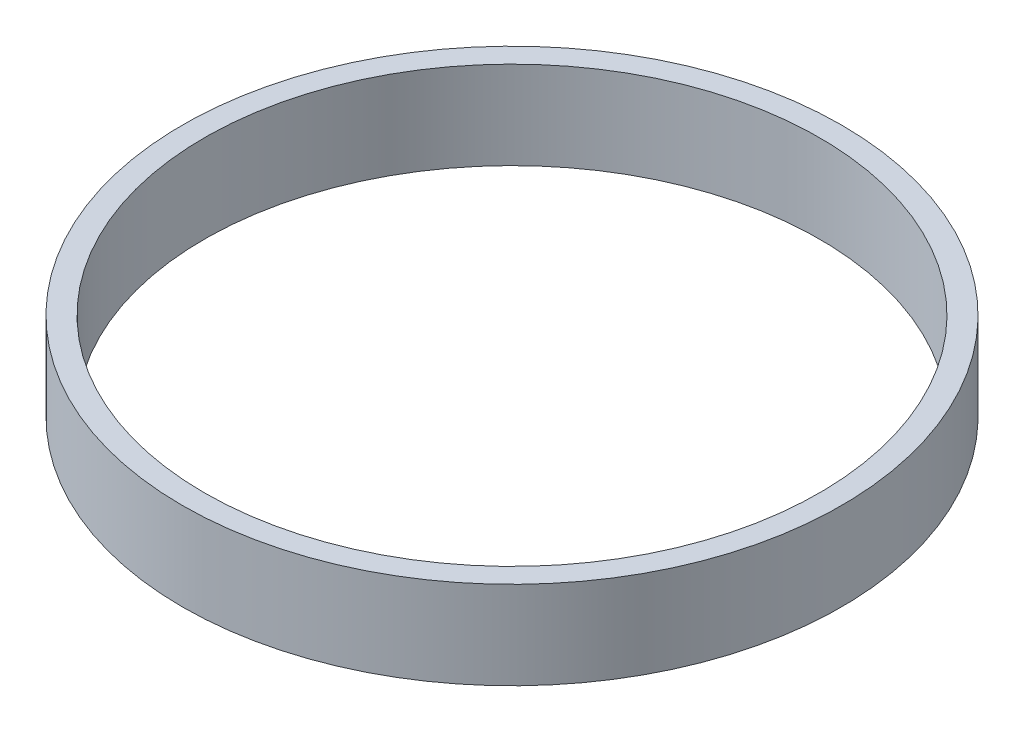
ISO-10303-21;
HEADER;
FILE_DESCRIPTION(('STEP AP214'),'2;1');
FILE_NAME('part.step','',(''),(''),'','','');
FILE_SCHEMA(('AUTOMOTIVE_DESIGN { 1 0 10303 214 1 1 1 1 }'));
ENDSEC;
DATA;
#1=APPLICATION_CONTEXT('core data for automotive mechanical design processes');
#2=APPLICATION_PROTOCOL_DEFINITION('international standard','automotive_design',2000,#1);
#3=PRODUCT_CONTEXT('',#1,'mechanical');
#4=PRODUCT('Part','Part','',(#3));
#5=PRODUCT_RELATED_PRODUCT_CATEGORY('part','',(#4));
#6=PRODUCT_DEFINITION_FORMATION('','',#4);
#7=PRODUCT_DEFINITION_CONTEXT('part definition',#1,'design');
#8=PRODUCT_DEFINITION('design','',#6,#7);
#9=PRODUCT_DEFINITION_SHAPE('','',#8);
#10=(LENGTH_UNIT() NAMED_UNIT(*) SI_UNIT(.MILLI.,.METRE.));
#11=(NAMED_UNIT(*) PLANE_ANGLE_UNIT() SI_UNIT($,.RADIAN.));
#12=(NAMED_UNIT(*) SI_UNIT($,.STERADIAN.) SOLID_ANGLE_UNIT());
#13=UNCERTAINTY_MEASURE_WITH_UNIT(LENGTH_MEASURE(1.E-05),#10,'distance_accuracy_value','');
#14=(GEOMETRIC_REPRESENTATION_CONTEXT(3) GLOBAL_UNCERTAINTY_ASSIGNED_CONTEXT((#13)) GLOBAL_UNIT_ASSIGNED_CONTEXT((#10,
#11,#12)) REPRESENTATION_CONTEXT('',''));
#15=CARTESIAN_POINT('',(0.,0.,0.));
#16=DIRECTION('',(0.,0.,1.));
#17=DIRECTION('',(1.,0.,0.));
#18=AXIS2_PLACEMENT_3D('',#15,#16,#17);
#19=CARTESIAN_POINT('',(0.,10.,0.));
#20=DIRECTION('',(0.,1.,0.));
#21=DIRECTION('',(0.,0.,1.));
#22=AXIS2_PLACEMENT_3D('',#19,#20,#21);
#23=PLANE('',#22);
#24=CARTESIAN_POINT('',(0.,10.,0.));
#25=DIRECTION('',(0.,1.,0.));
#26=DIRECTION('',(0.,0.,1.));
#27=AXIS2_PLACEMENT_3D('',#24,#25,#26);
#28=CIRCLE('',#27,37.5);
#29=CARTESIAN_POINT('',(0.,10.,37.5));
#30=VERTEX_POINT('',#29);
#31=EDGE_CURVE('E12',#30,#30,#28,.T.);
#32=ORIENTED_EDGE('',*,*,#31,.T.);
#33=EDGE_LOOP('',(#32));
#34=FACE_BOUND('',#33,.T.);
#35=CARTESIAN_POINT('',(0.,10.,0.));
#36=DIRECTION('',(0.,1.,0.));
#37=DIRECTION('',(0.,0.,1.));
#38=AXIS2_PLACEMENT_3D('',#35,#36,#37);
#39=CIRCLE('',#38,35.);
#40=CARTESIAN_POINT('',(0.,10.,35.));
#41=VERTEX_POINT('',#40);
#42=EDGE_CURVE('E51',#41,#41,#39,.T.);
#43=ORIENTED_EDGE('',*,*,#42,.F.);
#44=EDGE_LOOP('',(#43));
#45=FACE_BOUND('',#44,.T.);
#46=ADVANCED_FACE('F40',(#34,#45),#23,.T.);
#47=CARTESIAN_POINT('',(0.,0.,0.));
#48=DIRECTION('',(0.,1.,0.));
#49=DIRECTION('',(0.,0.,1.));
#50=AXIS2_PLACEMENT_3D('',#47,#48,#49);
#51=PLANE('',#50);
#52=CARTESIAN_POINT('',(0.,0.,0.));
#53=DIRECTION('',(0.,1.,0.));
#54=DIRECTION('',(0.,0.,1.));
#55=AXIS2_PLACEMENT_3D('',#52,#53,#54);
#56=CIRCLE('',#55,37.5);
#57=CARTESIAN_POINT('',(0.,0.,37.5));
#58=VERTEX_POINT('',#57);
#59=EDGE_CURVE('E44',#58,#58,#56,.T.);
#60=ORIENTED_EDGE('',*,*,#59,.F.);
#61=EDGE_LOOP('',(#60));
#62=FACE_BOUND('',#61,.T.);
#63=CARTESIAN_POINT('',(0.,0.,0.));
#64=DIRECTION('',(0.,1.,0.));
#65=DIRECTION('',(0.,0.,1.));
#66=AXIS2_PLACEMENT_3D('',#63,#64,#65);
#67=CIRCLE('',#66,35.);
#68=CARTESIAN_POINT('',(0.,0.,35.));
#69=VERTEX_POINT('',#68);
#70=EDGE_CURVE('E53',#69,#69,#67,.T.);
#71=ORIENTED_EDGE('',*,*,#70,.T.);
#72=EDGE_LOOP('',(#71));
#73=FACE_BOUND('',#72,.T.);
#74=ADVANCED_FACE('F63',(#62,#73),#51,.F.);
#75=CARTESIAN_POINT('',(0.,10.,0.));
#76=DIRECTION('',(0.,-1.,0.));
#77=DIRECTION('',(0.,0.,-1.));
#78=AXIS2_PLACEMENT_3D('',#75,#76,#77);
#79=CYLINDRICAL_SURFACE('',#78,37.5);
#80=ORIENTED_EDGE('',*,*,#31,.F.);
#81=EDGE_LOOP('',(#80));
#82=FACE_BOUND('',#81,.T.);
#83=ORIENTED_EDGE('',*,*,#59,.T.);
#84=EDGE_LOOP('',(#83));
#85=FACE_BOUND('',#84,.T.);
#86=ADVANCED_FACE('F42',(#82,#85),#79,.T.);
#87=CARTESIAN_POINT('',(0.,10.,0.));
#88=DIRECTION('',(0.,-1.,0.));
#89=DIRECTION('',(0.,0.,-1.));
#90=AXIS2_PLACEMENT_3D('',#87,#88,#89);
#91=CYLINDRICAL_SURFACE('',#90,35.);
#92=ORIENTED_EDGE('',*,*,#42,.T.);
#93=EDGE_LOOP('',(#92));
#94=FACE_BOUND('',#93,.T.);
#95=ORIENTED_EDGE('',*,*,#70,.F.);
#96=EDGE_LOOP('',(#95));
#97=FACE_BOUND('',#96,.T.);
#98=ADVANCED_FACE('F59',(#94,#97),#91,.F.);
#99=CLOSED_SHELL('',(#46,#74,#86,#98));
#100=MANIFOLD_SOLID_BREP('B2',#99);
#101=ADVANCED_BREP_SHAPE_REPRESENTATION('',(#18,#100),#14);
#102=SHAPE_DEFINITION_REPRESENTATION(#9,#101);
ENDSEC;
END-ISO-10303-21;
